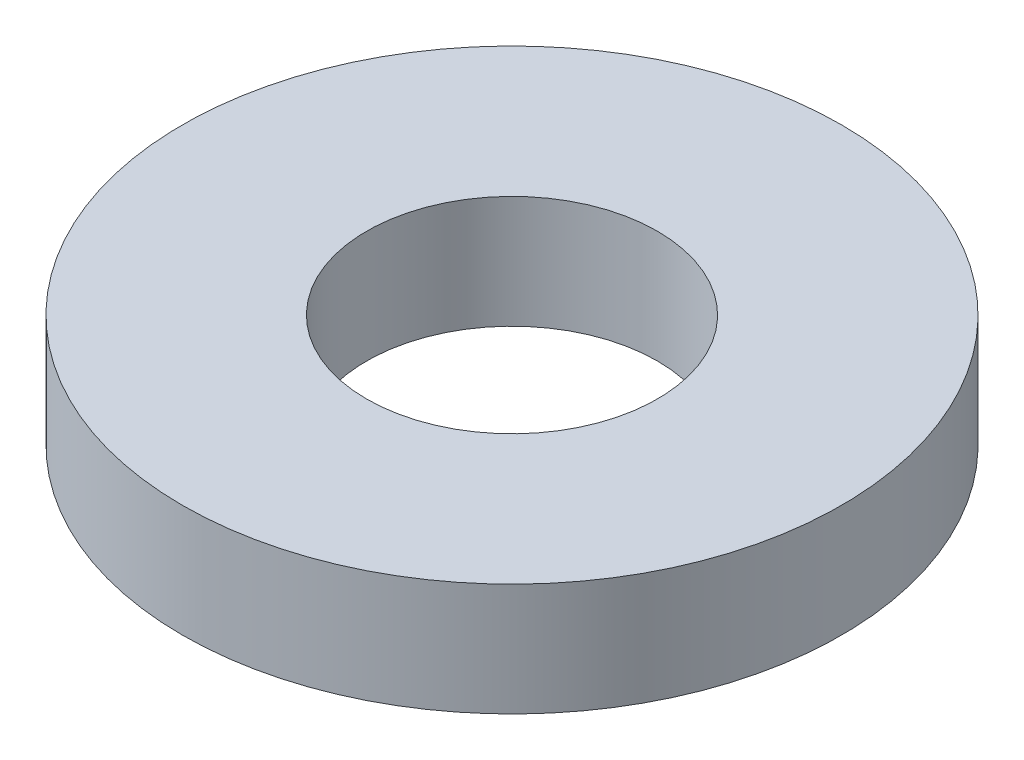
ISO-10303-21;
HEADER;
FILE_DESCRIPTION(('STEP AP214'),'2;1');
FILE_NAME('part.step','',(''),(''),'','','');
FILE_SCHEMA(('AUTOMOTIVE_DESIGN { 1 0 10303 214 1 1 1 1 }'));
ENDSEC;
DATA;
#1=APPLICATION_CONTEXT('core data for automotive mechanical design processes');
#2=APPLICATION_PROTOCOL_DEFINITION('international standard','automotive_design',2000,#1);
#3=PRODUCT_CONTEXT('',#1,'mechanical');
#4=PRODUCT('Part','Part','',(#3));
#5=PRODUCT_RELATED_PRODUCT_CATEGORY('part','',(#4));
#6=PRODUCT_DEFINITION_FORMATION('','',#4);
#7=PRODUCT_DEFINITION_CONTEXT('part definition',#1,'design');
#8=PRODUCT_DEFINITION('design','',#6,#7);
#9=PRODUCT_DEFINITION_SHAPE('','',#8);
#10=(LENGTH_UNIT() NAMED_UNIT(*) SI_UNIT(.MILLI.,.METRE.));
#11=(NAMED_UNIT(*) PLANE_ANGLE_UNIT() SI_UNIT($,.RADIAN.));
#12=(NAMED_UNIT(*) SI_UNIT($,.STERADIAN.) SOLID_ANGLE_UNIT());
#13=UNCERTAINTY_MEASURE_WITH_UNIT(LENGTH_MEASURE(1.E-05),#10,'distance_accuracy_value','');
#14=(GEOMETRIC_REPRESENTATION_CONTEXT(3) GLOBAL_UNCERTAINTY_ASSIGNED_CONTEXT((#13)) GLOBAL_UNIT_ASSIGNED_CONTEXT((#10,
#11,#12)) REPRESENTATION_CONTEXT('',''));
#15=CARTESIAN_POINT('',(0.,0.,0.));
#16=DIRECTION('',(0.,0.,1.));
#17=DIRECTION('',(1.,0.,0.));
#18=AXIS2_PLACEMENT_3D('',#15,#16,#17);
#19=CARTESIAN_POINT('',(0.,29.,0.));
#20=DIRECTION('',(0.,-1.,0.));
#21=DIRECTION('',(0.,0.,-1.));
#22=AXIS2_PLACEMENT_3D('',#19,#20,#21);
#23=CYLINDRICAL_SURFACE('',#22,85.);
#24=CARTESIAN_POINT('',(0.,29.,0.));
#25=DIRECTION('',(0.,1.,0.));
#26=DIRECTION('',(0.,0.,1.));
#27=AXIS2_PLACEMENT_3D('',#24,#25,#26);
#28=CIRCLE('',#27,85.);
#29=CARTESIAN_POINT('',(0.,29.,-85.));
#30=VERTEX_POINT('',#29);
#31=EDGE_CURVE('E10',#30,#30,#28,.T.);
#32=CARTESIAN_POINT('',(0.,0.,0.));
#33=DIRECTION('',(0.,1.,0.));
#34=DIRECTION('',(0.,0.,1.));
#35=AXIS2_PLACEMENT_3D('',#32,#33,#34);
#36=CIRCLE('',#35,85.);
#37=CARTESIAN_POINT('',(0.,0.,-85.));
#38=VERTEX_POINT('',#37);
#39=EDGE_CURVE('E37',#38,#38,#36,.T.);
#40=CARTESIAN_POINT('',(0.,29.,-85.));
#41=CARTESIAN_POINT('',(0.,28.6979166666667,-85.));
#42=CARTESIAN_POINT('',(0.,28.3958333333333,-85.));
#43=CARTESIAN_POINT('',(0.,27.7916666666667,-85.));
#44=CARTESIAN_POINT('',(0.,27.4895833333333,-85.));
#45=CARTESIAN_POINT('',(0.,26.8854166666667,-85.));
#46=CARTESIAN_POINT('',(0.,26.5833333333333,-85.));
#47=CARTESIAN_POINT('',(0.,25.9791666666667,-85.));
#48=CARTESIAN_POINT('',(0.,25.6770833333333,-85.));
#49=CARTESIAN_POINT('',(0.,25.0729166666667,-85.));
#50=CARTESIAN_POINT('',(0.,24.7708333333333,-85.));
#51=CARTESIAN_POINT('',(0.,24.1666666666667,-85.));
#52=CARTESIAN_POINT('',(0.,23.8645833333333,-85.));
#53=CARTESIAN_POINT('',(0.,23.2604166666667,-85.));
#54=CARTESIAN_POINT('',(0.,22.9583333333333,-85.));
#55=CARTESIAN_POINT('',(0.,22.3541666666667,-85.));
#56=CARTESIAN_POINT('',(0.,22.0520833333333,-85.));
#57=CARTESIAN_POINT('',(0.,21.4479166666667,-85.));
#58=CARTESIAN_POINT('',(0.,21.1458333333333,-85.));
#59=CARTESIAN_POINT('',(0.,20.5416666666667,-85.));
#60=CARTESIAN_POINT('',(0.,20.2395833333333,-85.));
#61=CARTESIAN_POINT('',(0.,19.6354166666667,-85.));
#62=CARTESIAN_POINT('',(0.,19.3333333333333,-85.));
#63=CARTESIAN_POINT('',(0.,18.7291666666667,-85.));
#64=CARTESIAN_POINT('',(0.,18.4270833333333,-85.));
#65=CARTESIAN_POINT('',(0.,17.8229166666667,-85.));
#66=CARTESIAN_POINT('',(0.,17.5208333333333,-85.));
#67=CARTESIAN_POINT('',(0.,16.9166666666667,-85.));
#68=CARTESIAN_POINT('',(0.,16.6145833333333,-85.));
#69=CARTESIAN_POINT('',(0.,16.0104166666667,-85.));
#70=CARTESIAN_POINT('',(0.,15.7083333333333,-85.));
#71=CARTESIAN_POINT('',(0.,15.1041666666667,-85.));
#72=CARTESIAN_POINT('',(0.,14.8020833333333,-85.));
#73=CARTESIAN_POINT('',(0.,14.1979166666667,-85.));
#74=CARTESIAN_POINT('',(0.,13.8958333333333,-85.));
#75=CARTESIAN_POINT('',(0.,13.2916666666667,-85.));
#76=CARTESIAN_POINT('',(0.,12.9895833333333,-85.));
#77=CARTESIAN_POINT('',(0.,12.3854166666667,-85.));
#78=CARTESIAN_POINT('',(0.,12.0833333333333,-85.));
#79=CARTESIAN_POINT('',(0.,11.4791666666667,-85.));
#80=CARTESIAN_POINT('',(0.,11.1770833333333,-85.));
#81=CARTESIAN_POINT('',(0.,10.5729166666667,-85.));
#82=CARTESIAN_POINT('',(0.,10.2708333333333,-85.));
#83=CARTESIAN_POINT('',(0.,9.66666666666667,-85.));
#84=CARTESIAN_POINT('',(0.,9.36458333333333,-85.));
#85=CARTESIAN_POINT('',(0.,8.76041666666667,-85.));
#86=CARTESIAN_POINT('',(0.,8.45833333333333,-85.));
#87=CARTESIAN_POINT('',(0.,7.85416666666667,-85.));
#88=CARTESIAN_POINT('',(0.,7.55208333333333,-85.));
#89=CARTESIAN_POINT('',(0.,6.94791666666667,-85.));
#90=CARTESIAN_POINT('',(0.,6.64583333333333,-85.));
#91=CARTESIAN_POINT('',(0.,6.04166666666667,-85.));
#92=CARTESIAN_POINT('',(0.,5.73958333333333,-85.));
#93=CARTESIAN_POINT('',(0.,5.13541666666667,-85.));
#94=CARTESIAN_POINT('',(0.,4.83333333333333,-85.));
#95=CARTESIAN_POINT('',(0.,4.22916666666667,-85.));
#96=CARTESIAN_POINT('',(0.,3.92708333333333,-85.));
#97=CARTESIAN_POINT('',(0.,3.32291666666667,-85.));
#98=CARTESIAN_POINT('',(0.,3.02083333333333,-85.));
#99=CARTESIAN_POINT('',(0.,2.41666666666667,-85.));
#100=CARTESIAN_POINT('',(0.,2.11458333333333,-85.));
#101=CARTESIAN_POINT('',(0.,1.51041666666667,-85.));
#102=CARTESIAN_POINT('',(0.,1.20833333333333,-85.));
#103=CARTESIAN_POINT('',(0.,0.604166666666667,-85.));
#104=CARTESIAN_POINT('',(0.,0.302083333333333,-85.));
#105=CARTESIAN_POINT('',(0.,0.,-85.));
#106=B_SPLINE_CURVE_WITH_KNOTS('',3,(#40,#41,#42,#43,#44,#45,#46,#47,#48,#49,#50,#51,#52,#53,
#54,#55,#56,#57,#58,#59,#60,#61,#62,#63,#64,#65,#66,#67,#68,#69,#70,#71,#72,#73,#74,#75,#76,#77,
#78,#79,#80,#81,#82,#83,#84,#85,#86,#87,#88,#89,#90,#91,#92,#93,#94,#95,#96,#97,#98,#99,#100,
#101,#102,#103,#104,#105),.UNSPECIFIED.,.F.,.F.,(4,2,2,2,2,2,2,2,2,2,2,2,2,2,2,2,2,2,2,2,2,2,2,
2,2,2,2,2,2,2,2,2,4),(0.,0.906249999999997,1.8125,2.71875,3.625,4.53125,5.4375,6.34375,7.25,
8.15625,9.0625,9.96875,10.875,11.78125,12.6875,13.59375,14.5,15.40625,16.3125,17.21875,18.125,
19.03125,19.9375,20.84375,21.75,22.65625,23.5625,24.46875,25.375,26.28125,27.1875,28.09375,29.),.UNSPECIFIED.);
#107=EDGE_CURVE('BSEAM40',#30,#38,#106,.T.);
#108=ORIENTED_EDGE('',*,*,#31,.F.);
#109=ORIENTED_EDGE('',*,*,#39,.T.);
#110=ORIENTED_EDGE('',*,*,#107,.T.);
#111=ORIENTED_EDGE('',*,*,#107,.F.);
#112=EDGE_LOOP('',(#108,#110,#109,#111));
#113=FACE_BOUND('',#112,.T.);
#114=ADVANCED_FACE('F40',(#113),#23,.T.);
#115=CARTESIAN_POINT('',(0.,29.,0.));
#116=DIRECTION('',(0.,1.,0.));
#117=DIRECTION('',(0.,0.,1.));
#118=AXIS2_PLACEMENT_3D('',#115,#116,#117);
#119=PLANE('',#118);
#120=CARTESIAN_POINT('',(0.,29.,0.));
#121=DIRECTION('',(0.,1.,0.));
#122=DIRECTION('',(0.,0.,1.));
#123=AXIS2_PLACEMENT_3D('',#120,#121,#122);
#124=CIRCLE('',#123,37.5);
#125=CARTESIAN_POINT('',(0.,29.,-37.5));
#126=VERTEX_POINT('',#125);
#127=EDGE_CURVE('E50',#126,#126,#124,.T.);
#128=ORIENTED_EDGE('',*,*,#127,.F.);
#129=EDGE_LOOP('',(#128));
#130=FACE_BOUND('',#129,.T.);
#131=ORIENTED_EDGE('',*,*,#31,.T.);
#132=EDGE_LOOP('',(#131));
#133=FACE_BOUND('',#132,.T.);
#134=ADVANCED_FACE('F59',(#130,#133),#119,.T.);
#135=CARTESIAN_POINT('',(0.,0.,0.));
#136=DIRECTION('',(0.,1.,0.));
#137=DIRECTION('',(0.,0.,1.));
#138=AXIS2_PLACEMENT_3D('',#135,#136,#137);
#139=PLANE('',#138);
#140=CARTESIAN_POINT('',(0.,0.,0.));
#141=DIRECTION('',(0.,1.,0.));
#142=DIRECTION('',(0.,0.,1.));
#143=AXIS2_PLACEMENT_3D('',#140,#141,#142);
#144=CIRCLE('',#143,37.5);
#145=CARTESIAN_POINT('',(0.,0.,-37.5));
#146=VERTEX_POINT('',#145);
#147=EDGE_CURVE('E47',#146,#146,#144,.T.);
#148=ORIENTED_EDGE('',*,*,#147,.T.);
#149=EDGE_LOOP('',(#148));
#150=FACE_BOUND('',#149,.T.);
#151=ORIENTED_EDGE('',*,*,#39,.F.);
#152=EDGE_LOOP('',(#151));
#153=FACE_BOUND('',#152,.T.);
#154=ADVANCED_FACE('F58',(#150,#153),#139,.F.);
#155=CARTESIAN_POINT('',(0.,29.,0.));
#156=DIRECTION('',(0.,-1.,0.));
#157=DIRECTION('',(0.,0.,-1.));
#158=AXIS2_PLACEMENT_3D('',#155,#156,#157);
#159=CYLINDRICAL_SURFACE('',#158,37.5);
#160=CARTESIAN_POINT('',(0.,29.,-37.5));
#161=CARTESIAN_POINT('',(0.,28.6979166666667,-37.5));
#162=CARTESIAN_POINT('',(0.,28.3958333333333,-37.5));
#163=CARTESIAN_POINT('',(0.,27.7916666666667,-37.5));
#164=CARTESIAN_POINT('',(0.,27.4895833333333,-37.5));
#165=CARTESIAN_POINT('',(0.,26.8854166666667,-37.5));
#166=CARTESIAN_POINT('',(0.,26.5833333333333,-37.5));
#167=CARTESIAN_POINT('',(0.,25.9791666666667,-37.5));
#168=CARTESIAN_POINT('',(0.,25.6770833333333,-37.5));
#169=CARTESIAN_POINT('',(0.,25.0729166666667,-37.5));
#170=CARTESIAN_POINT('',(0.,24.7708333333333,-37.5));
#171=CARTESIAN_POINT('',(0.,24.1666666666667,-37.5));
#172=CARTESIAN_POINT('',(0.,23.8645833333333,-37.5));
#173=CARTESIAN_POINT('',(0.,23.2604166666667,-37.5));
#174=CARTESIAN_POINT('',(0.,22.9583333333333,-37.5));
#175=CARTESIAN_POINT('',(0.,22.3541666666667,-37.5));
#176=CARTESIAN_POINT('',(0.,22.0520833333333,-37.5));
#177=CARTESIAN_POINT('',(0.,21.4479166666667,-37.5));
#178=CARTESIAN_POINT('',(0.,21.1458333333333,-37.5));
#179=CARTESIAN_POINT('',(0.,20.5416666666667,-37.5));
#180=CARTESIAN_POINT('',(0.,20.2395833333333,-37.5));
#181=CARTESIAN_POINT('',(0.,19.6354166666667,-37.5));
#182=CARTESIAN_POINT('',(0.,19.3333333333333,-37.5));
#183=CARTESIAN_POINT('',(0.,18.7291666666667,-37.5));
#184=CARTESIAN_POINT('',(0.,18.4270833333333,-37.5));
#185=CARTESIAN_POINT('',(0.,17.8229166666667,-37.5));
#186=CARTESIAN_POINT('',(0.,17.5208333333333,-37.5));
#187=CARTESIAN_POINT('',(0.,16.9166666666667,-37.5));
#188=CARTESIAN_POINT('',(0.,16.6145833333333,-37.5));
#189=CARTESIAN_POINT('',(0.,16.0104166666667,-37.5));
#190=CARTESIAN_POINT('',(0.,15.7083333333333,-37.5));
#191=CARTESIAN_POINT('',(0.,15.1041666666667,-37.5));
#192=CARTESIAN_POINT('',(0.,14.8020833333333,-37.5));
#193=CARTESIAN_POINT('',(0.,14.1979166666667,-37.5));
#194=CARTESIAN_POINT('',(0.,13.8958333333333,-37.5));
#195=CARTESIAN_POINT('',(0.,13.2916666666667,-37.5));
#196=CARTESIAN_POINT('',(0.,12.9895833333333,-37.5));
#197=CARTESIAN_POINT('',(0.,12.3854166666667,-37.5));
#198=CARTESIAN_POINT('',(0.,12.0833333333333,-37.5));
#199=CARTESIAN_POINT('',(0.,11.4791666666667,-37.5));
#200=CARTESIAN_POINT('',(0.,11.1770833333333,-37.5));
#201=CARTESIAN_POINT('',(0.,10.5729166666667,-37.5));
#202=CARTESIAN_POINT('',(0.,10.2708333333333,-37.5));
#203=CARTESIAN_POINT('',(0.,9.66666666666667,-37.5));
#204=CARTESIAN_POINT('',(0.,9.36458333333333,-37.5));
#205=CARTESIAN_POINT('',(0.,8.76041666666667,-37.5));
#206=CARTESIAN_POINT('',(0.,8.45833333333333,-37.5));
#207=CARTESIAN_POINT('',(0.,7.85416666666667,-37.5));
#208=CARTESIAN_POINT('',(0.,7.55208333333333,-37.5));
#209=CARTESIAN_POINT('',(0.,6.94791666666667,-37.5));
#210=CARTESIAN_POINT('',(0.,6.64583333333333,-37.5));
#211=CARTESIAN_POINT('',(0.,6.04166666666667,-37.5));
#212=CARTESIAN_POINT('',(0.,5.73958333333333,-37.5));
#213=CARTESIAN_POINT('',(0.,5.13541666666667,-37.5));
#214=CARTESIAN_POINT('',(0.,4.83333333333333,-37.5));
#215=CARTESIAN_POINT('',(0.,4.22916666666667,-37.5));
#216=CARTESIAN_POINT('',(0.,3.92708333333333,-37.5));
#217=CARTESIAN_POINT('',(0.,3.32291666666667,-37.5));
#218=CARTESIAN_POINT('',(0.,3.02083333333333,-37.5));
#219=CARTESIAN_POINT('',(0.,2.41666666666667,-37.5));
#220=CARTESIAN_POINT('',(0.,2.11458333333333,-37.5));
#221=CARTESIAN_POINT('',(0.,1.51041666666667,-37.5));
#222=CARTESIAN_POINT('',(0.,1.20833333333333,-37.5));
#223=CARTESIAN_POINT('',(0.,0.604166666666667,-37.5));
#224=CARTESIAN_POINT('',(0.,0.302083333333333,-37.5));
#225=CARTESIAN_POINT('',(0.,0.,-37.5));
#226=B_SPLINE_CURVE_WITH_KNOTS('',3,(#160,#161,#162,#163,#164,#165,#166,#167,#168,#169,#170,
#171,#172,#173,#174,#175,#176,#177,#178,#179,#180,#181,#182,#183,#184,#185,#186,#187,#188,#189,
#190,#191,#192,#193,#194,#195,#196,#197,#198,#199,#200,#201,#202,#203,#204,#205,#206,#207,#208,
#209,#210,#211,#212,#213,#214,#215,#216,#217,#218,#219,#220,#221,#222,#223,#224,#225),
.UNSPECIFIED.,.F.,.F.,(4,2,2,2,2,2,2,2,2,2,2,2,2,2,2,2,2,2,2,2,2,2,2,2,2,2,2,2,2,2,2,2,4),(0.,
0.906249999999997,1.8125,2.71875,3.625,4.53125,5.4375,6.34375,7.25,8.15625,9.0625,9.96875,
10.875,11.78125,12.6875,13.59375,14.5,15.40625,16.3125,17.21875,18.125,19.03125,19.9375,
20.84375,21.75,22.65625,23.5625,24.46875,25.375,26.28125,27.1875,28.09375,29.),.UNSPECIFIED.);
#227=EDGE_CURVE('BSEAM54',#126,#146,#226,.T.);
#228=ORIENTED_EDGE('',*,*,#127,.T.);
#229=ORIENTED_EDGE('',*,*,#147,.F.);
#230=ORIENTED_EDGE('',*,*,#227,.T.);
#231=ORIENTED_EDGE('',*,*,#227,.F.);
#232=EDGE_LOOP('',(#228,#230,#229,#231));
#233=FACE_BOUND('',#232,.T.);
#234=ADVANCED_FACE('F54',(#233),#159,.F.);
#235=CLOSED_SHELL('',(#114,#134,#154,#234));
#236=MANIFOLD_SOLID_BREP('B2',#235);
#237=ADVANCED_BREP_SHAPE_REPRESENTATION('',(#18,#236),#14);
#238=SHAPE_DEFINITION_REPRESENTATION(#9,#237);
ENDSEC;
END-ISO-10303-21;
